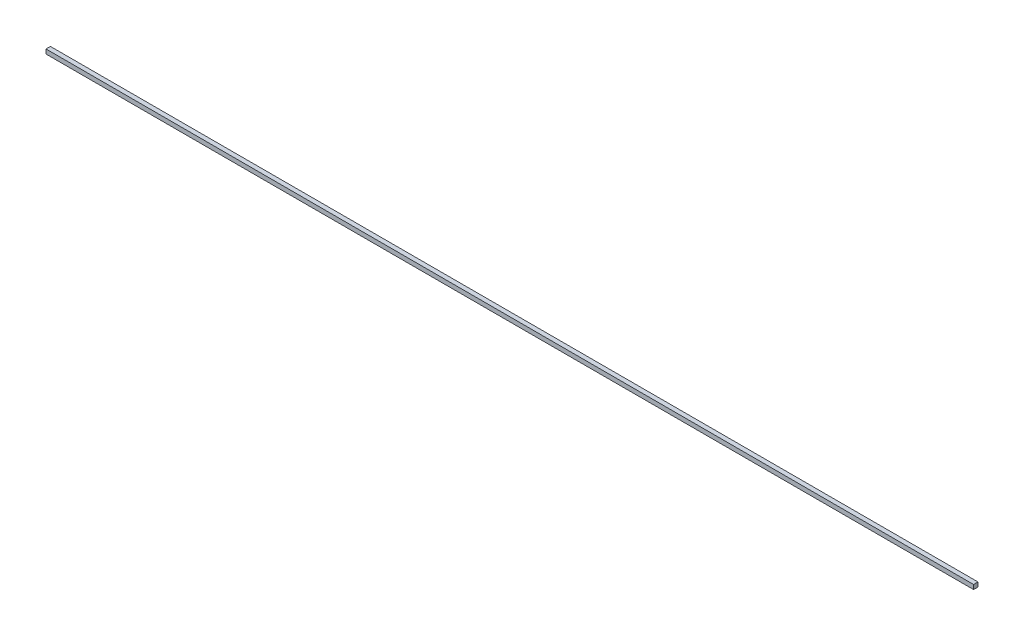
ISO-10303-21;
HEADER;
FILE_DESCRIPTION(('STEP AP214'),'2;1');
FILE_NAME('part.step','',(''),(''),'','','');
FILE_SCHEMA(('AUTOMOTIVE_DESIGN { 1 0 10303 214 1 1 1 1 }'));
ENDSEC;
DATA;
#1=APPLICATION_CONTEXT('core data for automotive mechanical design processes');
#2=APPLICATION_PROTOCOL_DEFINITION('international standard','automotive_design',2000,#1);
#3=PRODUCT_CONTEXT('',#1,'mechanical');
#4=PRODUCT('Part','Part','',(#3));
#5=PRODUCT_RELATED_PRODUCT_CATEGORY('part','',(#4));
#6=PRODUCT_DEFINITION_FORMATION('','',#4);
#7=PRODUCT_DEFINITION_CONTEXT('part definition',#1,'design');
#8=PRODUCT_DEFINITION('design','',#6,#7);
#9=PRODUCT_DEFINITION_SHAPE('','',#8);
#10=(LENGTH_UNIT() NAMED_UNIT(*) SI_UNIT(.MILLI.,.METRE.));
#11=(NAMED_UNIT(*) PLANE_ANGLE_UNIT() SI_UNIT($,.RADIAN.));
#12=(NAMED_UNIT(*) SI_UNIT($,.STERADIAN.) SOLID_ANGLE_UNIT());
#13=UNCERTAINTY_MEASURE_WITH_UNIT(LENGTH_MEASURE(1.E-05),#10,'distance_accuracy_value','');
#14=(GEOMETRIC_REPRESENTATION_CONTEXT(3) GLOBAL_UNCERTAINTY_ASSIGNED_CONTEXT((#13)) GLOBAL_UNIT_ASSIGNED_CONTEXT((#10,
#11,#12)) REPRESENTATION_CONTEXT('',''));
#15=CARTESIAN_POINT('',(0.,0.,0.));
#16=DIRECTION('',(0.,0.,1.));
#17=DIRECTION('',(1.,0.,0.));
#18=AXIS2_PLACEMENT_3D('',#15,#16,#17);
#19=CARTESIAN_POINT('',(-666.75,6.35,3.17500000000008));
#20=DIRECTION('',(1.,0.,0.));
#21=DIRECTION('',(0.,0.,-1.));
#22=AXIS2_PLACEMENT_3D('',#19,#20,#21);
#23=PLANE('',#22);
#24=DIRECTION('',(0.,0.,1.));
#25=VECTOR('',#24,1.);
#26=CARTESIAN_POINT('',(-666.75,0.,3.17500000000008));
#27=LINE('',#26,#25);
#28=CARTESIAN_POINT('',(-666.75,0.,-3.17499999999992));
#29=VERTEX_POINT('',#28);
#30=CARTESIAN_POINT('',(-666.75,0.,3.17500000000008));
#31=VERTEX_POINT('',#30);
#32=EDGE_CURVE('E113',#29,#31,#27,.T.);
#33=ORIENTED_EDGE('',*,*,#32,.T.);
#34=DIRECTION('',(0.,-1.,0.));
#35=VECTOR('',#34,1.);
#36=CARTESIAN_POINT('',(-666.75,6.35,3.17500000000008));
#37=LINE('',#36,#35);
#38=CARTESIAN_POINT('',(-666.75,6.35,3.17500000000008));
#39=VERTEX_POINT('',#38);
#40=EDGE_CURVE('E11',#39,#31,#37,.T.);
#41=ORIENTED_EDGE('',*,*,#40,.F.);
#42=DIRECTION('',(0.,0.,1.));
#43=VECTOR('',#42,1.);
#44=CARTESIAN_POINT('',(-666.75,6.35,3.17500000000008));
#45=LINE('',#44,#43);
#46=CARTESIAN_POINT('',(-666.75,6.35,-3.17499999999992));
#47=VERTEX_POINT('',#46);
#48=EDGE_CURVE('E97',#47,#39,#45,.T.);
#49=ORIENTED_EDGE('',*,*,#48,.F.);
#50=DIRECTION('',(0.,-1.,0.));
#51=VECTOR('',#50,1.);
#52=CARTESIAN_POINT('',(-666.75,6.35,-3.17499999999992));
#53=LINE('',#52,#51);
#54=EDGE_CURVE('E109',#47,#29,#53,.T.);
#55=ORIENTED_EDGE('',*,*,#54,.T.);
#56=EDGE_LOOP('',(#33,#41,#49,#55));
#57=FACE_BOUND('',#56,.T.);
#58=ADVANCED_FACE('F45',(#57),#23,.F.);
#59=CARTESIAN_POINT('',(666.75,6.35,3.17499999999992));
#60=DIRECTION('',(0.,0.,-1.));
#61=DIRECTION('',(-1.,0.,0.));
#62=AXIS2_PLACEMENT_3D('',#59,#60,#61);
#63=PLANE('',#62);
#64=DIRECTION('',(1.,0.,0.));
#65=VECTOR('',#64,1.);
#66=CARTESIAN_POINT('',(666.75,0.,3.17499999999992));
#67=LINE('',#66,#65);
#68=CARTESIAN_POINT('',(666.75,0.,3.17499999999992));
#69=VERTEX_POINT('',#68);
#70=EDGE_CURVE('E102',#31,#69,#67,.T.);
#71=ORIENTED_EDGE('',*,*,#70,.T.);
#72=DIRECTION('',(0.,-1.,0.));
#73=VECTOR('',#72,1.);
#74=CARTESIAN_POINT('',(666.75,6.35,3.17499999999992));
#75=LINE('',#74,#73);
#76=CARTESIAN_POINT('',(666.75,6.35,3.17499999999992));
#77=VERTEX_POINT('',#76);
#78=EDGE_CURVE('E54',#77,#69,#75,.T.);
#79=ORIENTED_EDGE('',*,*,#78,.F.);
#80=DIRECTION('',(1.,0.,0.));
#81=VECTOR('',#80,1.);
#82=CARTESIAN_POINT('',(666.75,6.35,3.17499999999992));
#83=LINE('',#82,#81);
#84=EDGE_CURVE('E92',#39,#77,#83,.T.);
#85=ORIENTED_EDGE('',*,*,#84,.F.);
#86=ORIENTED_EDGE('',*,*,#40,.T.);
#87=EDGE_LOOP('',(#71,#79,#85,#86));
#88=FACE_BOUND('',#87,.T.);
#89=ADVANCED_FACE('F101',(#88),#63,.F.);
#90=CARTESIAN_POINT('',(666.75,6.35,3.17499999999992));
#91=DIRECTION('',(-1.,0.,0.));
#92=DIRECTION('',(0.,0.,1.));
#93=AXIS2_PLACEMENT_3D('',#90,#91,#92);
#94=PLANE('',#93);
#95=DIRECTION('',(0.,0.,-1.));
#96=VECTOR('',#95,1.);
#97=CARTESIAN_POINT('',(666.75,0.,3.17499999999992));
#98=LINE('',#97,#96);
#99=CARTESIAN_POINT('',(666.75,0.,-3.17500000000008));
#100=VERTEX_POINT('',#99);
#101=EDGE_CURVE('E79',#69,#100,#98,.T.);
#102=ORIENTED_EDGE('',*,*,#101,.T.);
#103=DIRECTION('',(0.,-1.,0.));
#104=VECTOR('',#103,1.);
#105=CARTESIAN_POINT('',(666.75,6.35,-3.17500000000008));
#106=LINE('',#105,#104);
#107=CARTESIAN_POINT('',(666.75,6.35,-3.17500000000008));
#108=VERTEX_POINT('',#107);
#109=EDGE_CURVE('E104',#108,#100,#106,.T.);
#110=ORIENTED_EDGE('',*,*,#109,.F.);
#111=DIRECTION('',(0.,0.,-1.));
#112=VECTOR('',#111,1.);
#113=CARTESIAN_POINT('',(666.75,6.35,3.17499999999992));
#114=LINE('',#113,#112);
#115=EDGE_CURVE('E95',#77,#108,#114,.T.);
#116=ORIENTED_EDGE('',*,*,#115,.F.);
#117=ORIENTED_EDGE('',*,*,#78,.T.);
#118=EDGE_LOOP('',(#102,#110,#116,#117));
#119=FACE_BOUND('',#118,.T.);
#120=ADVANCED_FACE('F105',(#119),#94,.F.);
#121=CARTESIAN_POINT('',(666.75,6.35,-3.17500000000008));
#122=DIRECTION('',(0.,0.,1.));
#123=DIRECTION('',(1.,0.,0.));
#124=AXIS2_PLACEMENT_3D('',#121,#122,#123);
#125=PLANE('',#124);
#126=DIRECTION('',(-1.,0.,0.));
#127=VECTOR('',#126,1.);
#128=CARTESIAN_POINT('',(666.75,0.,-3.17500000000008));
#129=LINE('',#128,#127);
#130=EDGE_CURVE('E85',#100,#29,#129,.T.);
#131=ORIENTED_EDGE('',*,*,#130,.T.);
#132=ORIENTED_EDGE('',*,*,#54,.F.);
#133=DIRECTION('',(-1.,0.,0.));
#134=VECTOR('',#133,1.);
#135=CARTESIAN_POINT('',(666.75,6.35,-3.17500000000008));
#136=LINE('',#135,#134);
#137=EDGE_CURVE('E62',#108,#47,#136,.T.);
#138=ORIENTED_EDGE('',*,*,#137,.F.);
#139=ORIENTED_EDGE('',*,*,#109,.T.);
#140=EDGE_LOOP('',(#131,#132,#138,#139));
#141=FACE_BOUND('',#140,.T.);
#142=ADVANCED_FACE('F126',(#141),#125,.F.);
#143=CARTESIAN_POINT('',(0.,6.35,0.));
#144=DIRECTION('',(0.,1.,0.));
#145=DIRECTION('',(0.,0.,1.));
#146=AXIS2_PLACEMENT_3D('',#143,#144,#145);
#147=PLANE('',#146);
#148=ORIENTED_EDGE('',*,*,#48,.T.);
#149=ORIENTED_EDGE('',*,*,#84,.T.);
#150=ORIENTED_EDGE('',*,*,#115,.T.);
#151=ORIENTED_EDGE('',*,*,#137,.T.);
#152=EDGE_LOOP('',(#148,#149,#150,#151));
#153=FACE_BOUND('',#152,.T.);
#154=ADVANCED_FACE('F93',(#153),#147,.T.);
#155=CARTESIAN_POINT('',(0.,0.,0.));
#156=DIRECTION('',(0.,1.,0.));
#157=DIRECTION('',(0.,0.,1.));
#158=AXIS2_PLACEMENT_3D('',#155,#156,#157);
#159=PLANE('',#158);
#160=ORIENTED_EDGE('',*,*,#32,.F.);
#161=ORIENTED_EDGE('',*,*,#130,.F.);
#162=ORIENTED_EDGE('',*,*,#101,.F.);
#163=ORIENTED_EDGE('',*,*,#70,.F.);
#164=EDGE_LOOP('',(#160,#161,#162,#163));
#165=FACE_BOUND('',#164,.T.);
#166=ADVANCED_FACE('F129',(#165),#159,.F.);
#167=CLOSED_SHELL('',(#58,#89,#120,#142,#154,#166));
#168=MANIFOLD_SOLID_BREP('B2',#167);
#169=ADVANCED_BREP_SHAPE_REPRESENTATION('',(#18,#168),#14);
#170=SHAPE_DEFINITION_REPRESENTATION(#9,#169);
ENDSEC;
END-ISO-10303-21;
